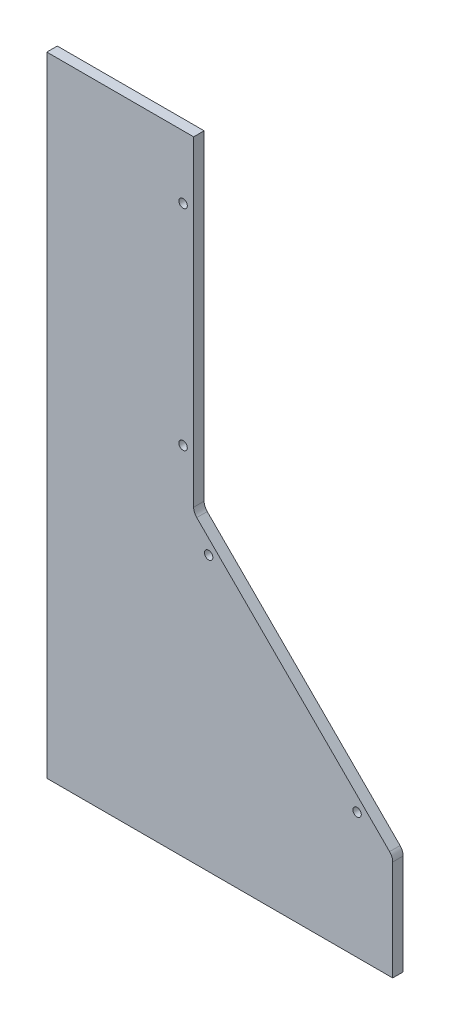
ISO-10303-21;
HEADER;
FILE_DESCRIPTION(('STEP AP214'),'2;1');
FILE_NAME('part.step','',(''),(''),'','','');
FILE_SCHEMA(('AUTOMOTIVE_DESIGN { 1 0 10303 214 1 1 1 1 }'));
ENDSEC;
DATA;
#1=APPLICATION_CONTEXT('core data for automotive mechanical design processes');
#2=APPLICATION_PROTOCOL_DEFINITION('international standard','automotive_design',2000,#1);
#3=PRODUCT_CONTEXT('',#1,'mechanical');
#4=PRODUCT('Part','Part','',(#3));
#5=PRODUCT_RELATED_PRODUCT_CATEGORY('part','',(#4));
#6=PRODUCT_DEFINITION_FORMATION('','',#4);
#7=PRODUCT_DEFINITION_CONTEXT('part definition',#1,'design');
#8=PRODUCT_DEFINITION('design','',#6,#7);
#9=PRODUCT_DEFINITION_SHAPE('','',#8);
#10=(LENGTH_UNIT() NAMED_UNIT(*) SI_UNIT(.MILLI.,.METRE.));
#11=(NAMED_UNIT(*) PLANE_ANGLE_UNIT() SI_UNIT($,.RADIAN.));
#12=(NAMED_UNIT(*) SI_UNIT($,.STERADIAN.) SOLID_ANGLE_UNIT());
#13=UNCERTAINTY_MEASURE_WITH_UNIT(LENGTH_MEASURE(1.E-05),#10,'distance_accuracy_value','');
#14=(GEOMETRIC_REPRESENTATION_CONTEXT(3) GLOBAL_UNCERTAINTY_ASSIGNED_CONTEXT((#13)) GLOBAL_UNIT_ASSIGNED_CONTEXT((#10,
#11,#12)) REPRESENTATION_CONTEXT('',''));
#15=CARTESIAN_POINT('',(0.,0.,0.));
#16=DIRECTION('',(0.,0.,1.));
#17=DIRECTION('',(1.,0.,0.));
#18=AXIS2_PLACEMENT_3D('',#15,#16,#17);
#19=CARTESIAN_POINT('',(135.072179453836,-15.3876586720822,0.));
#20=DIRECTION('',(0.,0.,1.));
#21=DIRECTION('',(1.,0.,0.));
#22=AXIS2_PLACEMENT_3D('',#19,#20,#21);
#23=PLANE('',#22);
#24=CARTESIAN_POINT('',(119.832179453836,-0.0385624187256711,0.));
#25=DIRECTION('',(0.,0.,-1.));
#26=DIRECTION('',(-1.,0.,0.));
#27=AXIS2_PLACEMENT_3D('',#24,#25,#26);
#28=CIRCLE('',#27,4.88950000000001);
#29=CARTESIAN_POINT('',(114.942679453836,-0.0385624187256711,0.));
#30=VERTEX_POINT('',#29);
#31=EDGE_CURVE('E354',#30,#30,#28,.T.);
#32=ORIENTED_EDGE('',*,*,#31,.F.);
#33=EDGE_LOOP('',(#32));
#34=FACE_BOUND('',#33,.T.);
#35=CARTESIAN_POINT('',(29.9161794538361,89.8774375812743,0.));
#36=DIRECTION('',(0.,0.,-1.));
#37=DIRECTION('',(-1.,0.,0.));
#38=AXIS2_PLACEMENT_3D('',#35,#36,#37);
#39=CIRCLE('',#38,4.8895);
#40=CARTESIAN_POINT('',(25.0266794538361,89.8774375812743,0.));
#41=VERTEX_POINT('',#40);
#42=EDGE_CURVE('E361',#41,#41,#39,.T.);
#43=ORIENTED_EDGE('',*,*,#42,.F.);
#44=EDGE_LOOP('',(#43));
#45=FACE_BOUND('',#44,.T.);
#46=CARTESIAN_POINT('',(14.4221794538361,266.661437581274,0.));
#47=DIRECTION('',(0.,0.,-1.));
#48=DIRECTION('',(-1.,0.,0.));
#49=AXIS2_PLACEMENT_3D('',#46,#47,#48);
#50=CIRCLE('',#49,4.8895);
#51=CARTESIAN_POINT('',(9.53267945383612,266.661437581274,0.));
#52=VERTEX_POINT('',#51);
#53=EDGE_CURVE('E379',#52,#52,#50,.T.);
#54=ORIENTED_EDGE('',*,*,#53,.F.);
#55=EDGE_LOOP('',(#54));
#56=FACE_BOUND('',#55,.T.);
#57=DIRECTION('',(1.,0.,0.));
#58=VECTOR('',#57,1.);
#59=CARTESIAN_POINT('',(141.422179453836,-76.2385624187257,0.));
#60=LINE('',#59,#58);
#61=CARTESIAN_POINT('',(-68.1278205461639,-76.2385624187257,0.));
#62=VERTEX_POINT('',#61);
#63=CARTESIAN_POINT('',(141.422179453836,-76.2385624187257,0.));
#64=VERTEX_POINT('',#63);
#65=EDGE_CURVE('E134',#62,#64,#60,.T.);
#66=ORIENTED_EDGE('',*,*,#65,.F.);
#67=DIRECTION('',(0.,1.,0.));
#68=VECTOR('',#67,1.);
#69=CARTESIAN_POINT('',(-68.1278205461639,-76.2385624187257,0.));
#70=LINE('',#69,#68);
#71=CARTESIAN_POINT('',(-68.1278205461639,304.761437581274,0.));
#72=VERTEX_POINT('',#71);
#73=EDGE_CURVE('E171',#62,#72,#70,.T.);
#74=ORIENTED_EDGE('',*,*,#73,.T.);
#75=DIRECTION('',(-1.,0.,0.));
#76=VECTOR('',#75,1.);
#77=CARTESIAN_POINT('',(-101.401820546164,304.761437581274,0.));
#78=LINE('',#77,#76);
#79=CARTESIAN_POINT('',(20.828,304.761437581274,0.));
#80=VERTEX_POINT('',#79);
#81=EDGE_CURVE('E84',#80,#72,#78,.T.);
#82=ORIENTED_EDGE('',*,*,#81,.F.);
#83=DIRECTION('',(0.,1.,0.));
#84=VECTOR('',#83,1.);
#85=CARTESIAN_POINT('',(20.828,110.451437581274,0.));
#86=LINE('',#85,#84);
#87=CARTESIAN_POINT('',(20.828,110.451437581274,0.));
#88=VERTEX_POINT('',#87);
#89=EDGE_CURVE('E143',#88,#80,#86,.T.);
#90=ORIENTED_EDGE('',*,*,#89,.F.);
#91=CARTESIAN_POINT('',(27.178,110.451437581274,0.));
#92=DIRECTION('',(0.,0.,-1.));
#93=DIRECTION('',(1.,0.,0.));
#94=AXIS2_PLACEMENT_3D('',#91,#92,#93);
#95=CIRCLE('',#94,6.35);
#96=CARTESIAN_POINT('',(22.7106474867722,105.938648917648,0.));
#97=VERTEX_POINT('',#96);
#98=EDGE_CURVE('E141',#97,#88,#95,.T.);
#99=ORIENTED_EDGE('',*,*,#98,.F.);
#100=DIRECTION('',(-0.707153282720981,0.707060276593828,0.));
#101=VECTOR('',#100,1.);
#102=CARTESIAN_POINT('',(22.7106474867722,105.938648917648,0.));
#103=LINE('',#102,#101);
#104=CARTESIAN_POINT('',(139.539531967064,-10.8748700084556,0.));
#105=VERTEX_POINT('',#104);
#106=EDGE_CURVE('E119',#105,#97,#103,.T.);
#107=ORIENTED_EDGE('',*,*,#106,.F.);
#108=CARTESIAN_POINT('',(135.072179453836,-15.3876586720822,0.));
#109=DIRECTION('',(0.,0.,1.));
#110=DIRECTION('',(1.,0.,0.));
#111=AXIS2_PLACEMENT_3D('',#108,#109,#110);
#112=CIRCLE('',#111,6.35);
#113=CARTESIAN_POINT('',(141.422179453836,-15.3876586720823,0.));
#114=VERTEX_POINT('',#113);
#115=EDGE_CURVE('E138',#114,#105,#112,.T.);
#116=ORIENTED_EDGE('',*,*,#115,.F.);
#117=DIRECTION('',(0.,1.,0.));
#118=VECTOR('',#117,1.);
#119=CARTESIAN_POINT('',(141.422179453836,-15.3876586720823,0.));
#120=LINE('',#119,#118);
#121=EDGE_CURVE('E136',#64,#114,#120,.T.);
#122=ORIENTED_EDGE('',*,*,#121,.F.);
#123=EDGE_LOOP('',(#66,#74,#82,#90,#99,#107,#116,#122));
#124=FACE_BOUND('',#123,.T.);
#125=CARTESIAN_POINT('',(14.4221794538361,139.661437581274,0.));
#126=DIRECTION('',(0.,0.,-1.));
#127=DIRECTION('',(-1.,0.,0.));
#128=AXIS2_PLACEMENT_3D('',#125,#126,#127);
#129=CIRCLE('',#128,4.8895);
#130=CARTESIAN_POINT('',(9.53267945383612,139.661437581274,0.));
#131=VERTEX_POINT('',#130);
#132=EDGE_CURVE('E370',#131,#131,#129,.T.);
#133=ORIENTED_EDGE('',*,*,#132,.F.);
#134=EDGE_LOOP('',(#133));
#135=FACE_BOUND('',#134,.T.);
#136=ADVANCED_FACE('F33',(#34,#45,#56,#124,#135),#23,.F.);
#137=CARTESIAN_POINT('',(141.422179453836,-76.2385624187257,6.35));
#138=DIRECTION('',(0.,1.,0.));
#139=DIRECTION('',(-1.,0.,0.));
#140=AXIS2_PLACEMENT_3D('',#137,#138,#139);
#141=PLANE('',#140);
#142=DIRECTION('',(1.,0.,0.));
#143=VECTOR('',#142,1.);
#144=CARTESIAN_POINT('',(-101.401820546164,-76.2385624187257,6.35));
#145=LINE('',#144,#143);
#146=CARTESIAN_POINT('',(-68.1278205461639,-76.2385624187257,6.35));
#147=VERTEX_POINT('',#146);
#148=CARTESIAN_POINT('',(141.422179453836,-76.2385624187257,6.35));
#149=VERTEX_POINT('',#148);
#150=EDGE_CURVE('E92',#147,#149,#145,.T.);
#151=ORIENTED_EDGE('',*,*,#150,.F.);
#152=DIRECTION('',(0.,0.,1.));
#153=VECTOR('',#152,1.);
#154=CARTESIAN_POINT('',(-68.1278205461639,-76.2385624187257,0.));
#155=LINE('',#154,#153);
#156=EDGE_CURVE('E169',#62,#147,#155,.T.);
#157=ORIENTED_EDGE('',*,*,#156,.F.);
#158=ORIENTED_EDGE('',*,*,#65,.T.);
#159=DIRECTION('',(0.,0.,-1.));
#160=VECTOR('',#159,1.);
#161=CARTESIAN_POINT('',(141.422179453836,-76.2385624187257,6.35));
#162=LINE('',#161,#160);
#163=EDGE_CURVE('E11',#149,#64,#162,.T.);
#164=ORIENTED_EDGE('',*,*,#163,.F.);
#165=EDGE_LOOP('',(#151,#157,#158,#164));
#166=FACE_BOUND('',#165,.T.);
#167=ADVANCED_FACE('F35',(#166),#141,.F.);
#168=CARTESIAN_POINT('',(141.422179453836,-15.3876586720823,6.35));
#169=DIRECTION('',(-1.,0.,0.));
#170=DIRECTION('',(0.,0.,1.));
#171=AXIS2_PLACEMENT_3D('',#168,#169,#170);
#172=PLANE('',#171);
#173=ORIENTED_EDGE('',*,*,#121,.T.);
#174=DIRECTION('',(0.,0.,-1.));
#175=VECTOR('',#174,1.);
#176=CARTESIAN_POINT('',(141.422179453836,-15.3876586720823,6.35));
#177=LINE('',#176,#175);
#178=CARTESIAN_POINT('',(141.422179453836,-15.3876586720823,6.35));
#179=VERTEX_POINT('',#178);
#180=EDGE_CURVE('E41',#179,#114,#177,.T.);
#181=ORIENTED_EDGE('',*,*,#180,.F.);
#182=DIRECTION('',(0.,1.,0.));
#183=VECTOR('',#182,1.);
#184=CARTESIAN_POINT('',(141.422179453836,-15.3876586720823,6.35));
#185=LINE('',#184,#183);
#186=EDGE_CURVE('E179',#149,#179,#185,.T.);
#187=ORIENTED_EDGE('',*,*,#186,.F.);
#188=ORIENTED_EDGE('',*,*,#163,.T.);
#189=EDGE_LOOP('',(#173,#181,#187,#188));
#190=FACE_BOUND('',#189,.T.);
#191=ADVANCED_FACE('F180',(#190),#172,.F.);
#192=CARTESIAN_POINT('',(135.072179453836,-15.3876586720822,6.35));
#193=DIRECTION('',(0.,0.,-1.));
#194=DIRECTION('',(-1.,0.,0.));
#195=AXIS2_PLACEMENT_3D('',#192,#193,#194);
#196=CYLINDRICAL_SURFACE('',#195,6.35);
#197=ORIENTED_EDGE('',*,*,#115,.T.);
#198=DIRECTION('',(0.,0.,-1.));
#199=VECTOR('',#198,1.);
#200=CARTESIAN_POINT('',(139.539531967064,-10.8748700084556,6.35));
#201=LINE('',#200,#199);
#202=CARTESIAN_POINT('',(139.539531967064,-10.8748700084556,6.35));
#203=VERTEX_POINT('',#202);
#204=EDGE_CURVE('E122',#203,#105,#201,.T.);
#205=ORIENTED_EDGE('',*,*,#204,.F.);
#206=CARTESIAN_POINT('',(135.072179453836,-15.3876586720822,6.35));
#207=DIRECTION('',(0.,0.,1.));
#208=DIRECTION('',(1.,0.,0.));
#209=AXIS2_PLACEMENT_3D('',#206,#207,#208);
#210=CIRCLE('',#209,6.35);
#211=EDGE_CURVE('E110',#179,#203,#210,.T.);
#212=ORIENTED_EDGE('',*,*,#211,.F.);
#213=ORIENTED_EDGE('',*,*,#180,.T.);
#214=EDGE_LOOP('',(#197,#205,#212,#213));
#215=FACE_BOUND('',#214,.T.);
#216=ADVANCED_FACE('F153',(#215),#196,.T.);
#217=CARTESIAN_POINT('',(22.7106474867722,105.938648917648,6.35));
#218=DIRECTION('',(-0.707060276593827,-0.707153282720981,0.));
#219=DIRECTION('',(0.707153282720981,-0.707060276593828,0.));
#220=AXIS2_PLACEMENT_3D('',#217,#218,#219);
#221=PLANE('',#220);
#222=ORIENTED_EDGE('',*,*,#106,.T.);
#223=DIRECTION('',(0.,0.,-1.));
#224=VECTOR('',#223,1.);
#225=CARTESIAN_POINT('',(22.7106474867722,105.938648917648,6.35));
#226=LINE('',#225,#224);
#227=CARTESIAN_POINT('',(22.7106474867722,105.938648917648,6.35));
#228=VERTEX_POINT('',#227);
#229=EDGE_CURVE('E116',#228,#97,#226,.T.);
#230=ORIENTED_EDGE('',*,*,#229,.F.);
#231=DIRECTION('',(-0.707153282720981,0.707060276593828,0.));
#232=VECTOR('',#231,1.);
#233=CARTESIAN_POINT('',(22.7106474867722,105.938648917648,6.35));
#234=LINE('',#233,#232);
#235=EDGE_CURVE('E103',#203,#228,#234,.T.);
#236=ORIENTED_EDGE('',*,*,#235,.F.);
#237=ORIENTED_EDGE('',*,*,#204,.T.);
#238=EDGE_LOOP('',(#222,#230,#236,#237));
#239=FACE_BOUND('',#238,.T.);
#240=ADVANCED_FACE('F117',(#239),#221,.F.);
#241=CARTESIAN_POINT('',(27.178,110.451437581274,6.35));
#242=DIRECTION('',(0.,0.,-1.));
#243=DIRECTION('',(-1.,0.,0.));
#244=AXIS2_PLACEMENT_3D('',#241,#242,#243);
#245=CYLINDRICAL_SURFACE('',#244,6.35);
#246=ORIENTED_EDGE('',*,*,#98,.T.);
#247=DIRECTION('',(0.,0.,-1.));
#248=VECTOR('',#247,1.);
#249=CARTESIAN_POINT('',(20.828,110.451437581274,6.35));
#250=LINE('',#249,#248);
#251=CARTESIAN_POINT('',(20.828,110.451437581274,6.35));
#252=VERTEX_POINT('',#251);
#253=EDGE_CURVE('E123',#252,#88,#250,.T.);
#254=ORIENTED_EDGE('',*,*,#253,.F.);
#255=CARTESIAN_POINT('',(27.178,110.451437581274,6.35));
#256=DIRECTION('',(0.,0.,-1.));
#257=DIRECTION('',(1.,0.,0.));
#258=AXIS2_PLACEMENT_3D('',#255,#256,#257);
#259=CIRCLE('',#258,6.35);
#260=EDGE_CURVE('E107',#228,#252,#259,.T.);
#261=ORIENTED_EDGE('',*,*,#260,.F.);
#262=ORIENTED_EDGE('',*,*,#229,.T.);
#263=EDGE_LOOP('',(#246,#254,#261,#262));
#264=FACE_BOUND('',#263,.T.);
#265=ADVANCED_FACE('F125',(#264),#245,.F.);
#266=CARTESIAN_POINT('',(20.828,110.451437581274,6.35));
#267=DIRECTION('',(-1.,0.,0.));
#268=DIRECTION('',(0.,0.,1.));
#269=AXIS2_PLACEMENT_3D('',#266,#267,#268);
#270=PLANE('',#269);
#271=ORIENTED_EDGE('',*,*,#89,.T.);
#272=DIRECTION('',(0.,0.,-1.));
#273=VECTOR('',#272,1.);
#274=CARTESIAN_POINT('',(20.828,304.761437581274,6.35));
#275=LINE('',#274,#273);
#276=CARTESIAN_POINT('',(20.828,304.761437581274,6.35));
#277=VERTEX_POINT('',#276);
#278=EDGE_CURVE('E133',#277,#80,#275,.T.);
#279=ORIENTED_EDGE('',*,*,#278,.F.);
#280=DIRECTION('',(0.,1.,0.));
#281=VECTOR('',#280,1.);
#282=CARTESIAN_POINT('',(20.828,110.451437581274,6.35));
#283=LINE('',#282,#281);
#284=EDGE_CURVE('E57',#252,#277,#283,.T.);
#285=ORIENTED_EDGE('',*,*,#284,.F.);
#286=ORIENTED_EDGE('',*,*,#253,.T.);
#287=EDGE_LOOP('',(#271,#279,#285,#286));
#288=FACE_BOUND('',#287,.T.);
#289=ADVANCED_FACE('F160',(#288),#270,.F.);
#290=CARTESIAN_POINT('',(-101.401820546164,304.761437581274,6.35));
#291=DIRECTION('',(0.,-1.,0.));
#292=DIRECTION('',(0.,0.,-1.));
#293=AXIS2_PLACEMENT_3D('',#290,#291,#292);
#294=PLANE('',#293);
#295=ORIENTED_EDGE('',*,*,#81,.T.);
#296=DIRECTION('',(0.,0.,1.));
#297=VECTOR('',#296,1.);
#298=CARTESIAN_POINT('',(-68.1278205461639,304.761437581274,0.));
#299=LINE('',#298,#297);
#300=CARTESIAN_POINT('',(-68.1278205461639,304.761437581274,6.35));
#301=VERTEX_POINT('',#300);
#302=EDGE_CURVE('E48',#72,#301,#299,.T.);
#303=ORIENTED_EDGE('',*,*,#302,.T.);
#304=DIRECTION('',(-1.,0.,0.));
#305=VECTOR('',#304,1.);
#306=CARTESIAN_POINT('',(20.828,304.761437581274,6.35));
#307=LINE('',#306,#305);
#308=EDGE_CURVE('E128',#277,#301,#307,.T.);
#309=ORIENTED_EDGE('',*,*,#308,.F.);
#310=ORIENTED_EDGE('',*,*,#278,.T.);
#311=EDGE_LOOP('',(#295,#303,#309,#310));
#312=FACE_BOUND('',#311,.T.);
#313=ADVANCED_FACE('F163',(#312),#294,.F.);
#314=CARTESIAN_POINT('',(135.072179453836,-15.3876586720822,6.35));
#315=DIRECTION('',(0.,0.,1.));
#316=DIRECTION('',(1.,0.,0.));
#317=AXIS2_PLACEMENT_3D('',#314,#315,#316);
#318=PLANE('',#317);
#319=CARTESIAN_POINT('',(119.832179453836,-0.0385624187256711,6.35));
#320=DIRECTION('',(0.,0.,-1.));
#321=DIRECTION('',(-1.,0.,0.));
#322=AXIS2_PLACEMENT_3D('',#319,#320,#321);
#323=CIRCLE('',#322,2.55269999999999);
#324=CARTESIAN_POINT('',(117.279479453836,-0.0385624187256711,6.35));
#325=VERTEX_POINT('',#324);
#326=EDGE_CURVE('E356',#325,#325,#323,.T.);
#327=ORIENTED_EDGE('',*,*,#326,.T.);
#328=EDGE_LOOP('',(#327));
#329=FACE_BOUND('',#328,.T.);
#330=CARTESIAN_POINT('',(29.9161794538361,89.8774375812743,6.35));
#331=DIRECTION('',(0.,0.,-1.));
#332=DIRECTION('',(-1.,0.,0.));
#333=AXIS2_PLACEMENT_3D('',#330,#331,#332);
#334=CIRCLE('',#333,2.55269999999999);
#335=CARTESIAN_POINT('',(27.3634794538361,89.8774375812743,6.35));
#336=VERTEX_POINT('',#335);
#337=EDGE_CURVE('E367',#336,#336,#334,.T.);
#338=ORIENTED_EDGE('',*,*,#337,.T.);
#339=EDGE_LOOP('',(#338));
#340=FACE_BOUND('',#339,.T.);
#341=CARTESIAN_POINT('',(14.4221794538361,139.661437581274,6.35));
#342=DIRECTION('',(0.,0.,-1.));
#343=DIRECTION('',(-1.,0.,0.));
#344=AXIS2_PLACEMENT_3D('',#341,#342,#343);
#345=CIRCLE('',#344,2.55269999999999);
#346=CARTESIAN_POINT('',(11.8694794538361,139.661437581274,6.35));
#347=VERTEX_POINT('',#346);
#348=EDGE_CURVE('E376',#347,#347,#345,.T.);
#349=ORIENTED_EDGE('',*,*,#348,.T.);
#350=EDGE_LOOP('',(#349));
#351=FACE_BOUND('',#350,.T.);
#352=CARTESIAN_POINT('',(14.4221794538361,266.661437581274,6.35));
#353=DIRECTION('',(0.,0.,-1.));
#354=DIRECTION('',(-1.,0.,0.));
#355=AXIS2_PLACEMENT_3D('',#352,#353,#354);
#356=CIRCLE('',#355,2.55269999999999);
#357=CARTESIAN_POINT('',(11.8694794538361,266.661437581274,6.35));
#358=VERTEX_POINT('',#357);
#359=EDGE_CURVE('E385',#358,#358,#356,.T.);
#360=ORIENTED_EDGE('',*,*,#359,.T.);
#361=EDGE_LOOP('',(#360));
#362=FACE_BOUND('',#361,.T.);
#363=DIRECTION('',(0.,1.,0.));
#364=VECTOR('',#363,1.);
#365=CARTESIAN_POINT('',(-68.1278205461639,-76.2385624187257,6.35));
#366=LINE('',#365,#364);
#367=EDGE_CURVE('E165',#147,#301,#366,.T.);
#368=ORIENTED_EDGE('',*,*,#367,.F.);
#369=ORIENTED_EDGE('',*,*,#150,.T.);
#370=ORIENTED_EDGE('',*,*,#186,.T.);
#371=ORIENTED_EDGE('',*,*,#211,.T.);
#372=ORIENTED_EDGE('',*,*,#235,.T.);
#373=ORIENTED_EDGE('',*,*,#260,.T.);
#374=ORIENTED_EDGE('',*,*,#284,.T.);
#375=ORIENTED_EDGE('',*,*,#308,.T.);
#376=EDGE_LOOP('',(#368,#369,#370,#371,#372,#373,#374,#375));
#377=FACE_BOUND('',#376,.T.);
#378=ADVANCED_FACE('F105',(#329,#340,#351,#362,#377),#318,.T.);
#379=CARTESIAN_POINT('',(-68.1278205461639,-76.2385624187257,0.));
#380=DIRECTION('',(1.,0.,0.));
#381=DIRECTION('',(0.,0.,-1.));
#382=AXIS2_PLACEMENT_3D('',#379,#380,#381);
#383=PLANE('',#382);
#384=ORIENTED_EDGE('',*,*,#367,.T.);
#385=ORIENTED_EDGE('',*,*,#302,.F.);
#386=ORIENTED_EDGE('',*,*,#73,.F.);
#387=ORIENTED_EDGE('',*,*,#156,.T.);
#388=EDGE_LOOP('',(#384,#385,#386,#387));
#389=FACE_BOUND('',#388,.T.);
#390=ADVANCED_FACE('F170',(#389),#383,.F.);
#391=CARTESIAN_POINT('',(14.4221794538361,266.661437581274,0.));
#392=DIRECTION('',(0.,0.,-1.));
#393=DIRECTION('',(-1.,0.,0.));
#394=AXIS2_PLACEMENT_3D('',#391,#392,#393);
#395=CYLINDRICAL_SURFACE('',#394,2.55269999999999);
#396=ORIENTED_EDGE('',*,*,#359,.F.);
#397=EDGE_LOOP('',(#396));
#398=FACE_BOUND('',#397,.T.);
#399=CARTESIAN_POINT('',(14.4221794538361,266.661437581274,1.96080801813508));
#400=DIRECTION('',(0.,0.,-1.));
#401=DIRECTION('',(-1.,0.,0.));
#402=AXIS2_PLACEMENT_3D('',#399,#400,#401);
#403=CIRCLE('',#402,2.55269999999999);
#404=CARTESIAN_POINT('',(11.8694794538361,266.661437581274,1.96080801813508));
#405=VERTEX_POINT('',#404);
#406=EDGE_CURVE('E382',#405,#405,#403,.T.);
#407=ORIENTED_EDGE('',*,*,#406,.T.);
#408=EDGE_LOOP('',(#407));
#409=FACE_BOUND('',#408,.T.);
#410=ADVANCED_FACE('F237',(#398,#409),#395,.F.);
#411=CARTESIAN_POINT('',(14.4221794538361,266.661437581274,0.));
#412=DIRECTION('',(0.,0.,-1.));
#413=DIRECTION('',(-1.,0.,0.));
#414=AXIS2_PLACEMENT_3D('',#411,#412,#413);
#415=CONICAL_SURFACE('',#414,4.8895,0.872664625997163);
#416=ORIENTED_EDGE('',*,*,#406,.F.);
#417=EDGE_LOOP('',(#416));
#418=FACE_BOUND('',#417,.T.);
#419=ORIENTED_EDGE('',*,*,#53,.T.);
#420=EDGE_LOOP('',(#419));
#421=FACE_BOUND('',#420,.T.);
#422=ADVANCED_FACE('F242',(#418,#421),#415,.F.);
#423=CARTESIAN_POINT('',(14.4221794538361,139.661437581274,0.));
#424=DIRECTION('',(0.,0.,-1.));
#425=DIRECTION('',(-1.,0.,0.));
#426=AXIS2_PLACEMENT_3D('',#423,#424,#425);
#427=CYLINDRICAL_SURFACE('',#426,2.55269999999999);
#428=ORIENTED_EDGE('',*,*,#348,.F.);
#429=EDGE_LOOP('',(#428));
#430=FACE_BOUND('',#429,.T.);
#431=CARTESIAN_POINT('',(14.4221794538361,139.661437581274,1.96080801813508));
#432=DIRECTION('',(0.,0.,-1.));
#433=DIRECTION('',(-1.,0.,0.));
#434=AXIS2_PLACEMENT_3D('',#431,#432,#433);
#435=CIRCLE('',#434,2.55269999999999);
#436=CARTESIAN_POINT('',(11.8694794538361,139.661437581274,1.96080801813508));
#437=VERTEX_POINT('',#436);
#438=EDGE_CURVE('E373',#437,#437,#435,.T.);
#439=ORIENTED_EDGE('',*,*,#438,.T.);
#440=EDGE_LOOP('',(#439));
#441=FACE_BOUND('',#440,.T.);
#442=ADVANCED_FACE('F250',(#430,#441),#427,.F.);
#443=CARTESIAN_POINT('',(14.4221794538361,139.661437581274,0.));
#444=DIRECTION('',(0.,0.,-1.));
#445=DIRECTION('',(-1.,0.,0.));
#446=AXIS2_PLACEMENT_3D('',#443,#444,#445);
#447=CONICAL_SURFACE('',#446,4.8895,0.872664625997163);
#448=ORIENTED_EDGE('',*,*,#438,.F.);
#449=EDGE_LOOP('',(#448));
#450=FACE_BOUND('',#449,.T.);
#451=ORIENTED_EDGE('',*,*,#132,.T.);
#452=EDGE_LOOP('',(#451));
#453=FACE_BOUND('',#452,.T.);
#454=ADVANCED_FACE('F258',(#450,#453),#447,.F.);
#455=CARTESIAN_POINT('',(29.9161794538361,89.8774375812743,0.));
#456=DIRECTION('',(0.,0.,-1.));
#457=DIRECTION('',(-1.,0.,0.));
#458=AXIS2_PLACEMENT_3D('',#455,#456,#457);
#459=CYLINDRICAL_SURFACE('',#458,2.55269999999999);
#460=ORIENTED_EDGE('',*,*,#337,.F.);
#461=EDGE_LOOP('',(#460));
#462=FACE_BOUND('',#461,.T.);
#463=CARTESIAN_POINT('',(29.9161794538361,89.8774375812743,1.96080801813508));
#464=DIRECTION('',(0.,0.,-1.));
#465=DIRECTION('',(-1.,0.,0.));
#466=AXIS2_PLACEMENT_3D('',#463,#464,#465);
#467=CIRCLE('',#466,2.55269999999999);
#468=CARTESIAN_POINT('',(27.3634794538361,89.8774375812743,1.96080801813508));
#469=VERTEX_POINT('',#468);
#470=EDGE_CURVE('E364',#469,#469,#467,.T.);
#471=ORIENTED_EDGE('',*,*,#470,.T.);
#472=EDGE_LOOP('',(#471));
#473=FACE_BOUND('',#472,.T.);
#474=ADVANCED_FACE('F266',(#462,#473),#459,.F.);
#475=CARTESIAN_POINT('',(29.9161794538361,89.8774375812743,0.));
#476=DIRECTION('',(0.,0.,-1.));
#477=DIRECTION('',(-1.,0.,0.));
#478=AXIS2_PLACEMENT_3D('',#475,#476,#477);
#479=CONICAL_SURFACE('',#478,4.8895,0.872664625997163);
#480=ORIENTED_EDGE('',*,*,#470,.F.);
#481=EDGE_LOOP('',(#480));
#482=FACE_BOUND('',#481,.T.);
#483=ORIENTED_EDGE('',*,*,#42,.T.);
#484=EDGE_LOOP('',(#483));
#485=FACE_BOUND('',#484,.T.);
#486=ADVANCED_FACE('F274',(#482,#485),#479,.F.);
#487=CARTESIAN_POINT('',(119.832179453836,-0.0385624187256711,0.));
#488=DIRECTION('',(0.,0.,-1.));
#489=DIRECTION('',(-1.,0.,0.));
#490=AXIS2_PLACEMENT_3D('',#487,#488,#489);
#491=CYLINDRICAL_SURFACE('',#490,2.55269999999999);
#492=ORIENTED_EDGE('',*,*,#326,.F.);
#493=EDGE_LOOP('',(#492));
#494=FACE_BOUND('',#493,.T.);
#495=CARTESIAN_POINT('',(119.832179453836,-0.0385624187256711,1.96080801813508));
#496=DIRECTION('',(0.,0.,-1.));
#497=DIRECTION('',(-1.,0.,0.));
#498=AXIS2_PLACEMENT_3D('',#495,#496,#497);
#499=CIRCLE('',#498,2.55269999999999);
#500=CARTESIAN_POINT('',(117.279479453836,-0.0385624187256711,1.96080801813508));
#501=VERTEX_POINT('',#500);
#502=EDGE_CURVE('E352',#501,#501,#499,.T.);
#503=ORIENTED_EDGE('',*,*,#502,.T.);
#504=EDGE_LOOP('',(#503));
#505=FACE_BOUND('',#504,.T.);
#506=ADVANCED_FACE('F282',(#494,#505),#491,.F.);
#507=CARTESIAN_POINT('',(119.832179453836,-0.0385624187256711,0.));
#508=DIRECTION('',(0.,0.,-1.));
#509=DIRECTION('',(-1.,0.,0.));
#510=AXIS2_PLACEMENT_3D('',#507,#508,#509);
#511=CONICAL_SURFACE('',#510,4.88950000000001,0.872664625997165);
#512=ORIENTED_EDGE('',*,*,#502,.F.);
#513=EDGE_LOOP('',(#512));
#514=FACE_BOUND('',#513,.T.);
#515=ORIENTED_EDGE('',*,*,#31,.T.);
#516=EDGE_LOOP('',(#515));
#517=FACE_BOUND('',#516,.T.);
#518=ADVANCED_FACE('F290',(#514,#517),#511,.F.);
#519=CLOSED_SHELL('',(#136,#167,#191,#216,#240,#265,#289,#313,#378,#390,#410,#422,#442,#454,
#474,#486,#506,#518));
#520=MANIFOLD_SOLID_BREP('B2',#519);
#521=ADVANCED_BREP_SHAPE_REPRESENTATION('',(#18,#520),#14);
#522=SHAPE_DEFINITION_REPRESENTATION(#9,#521);
ENDSEC;
END-ISO-10303-21;
